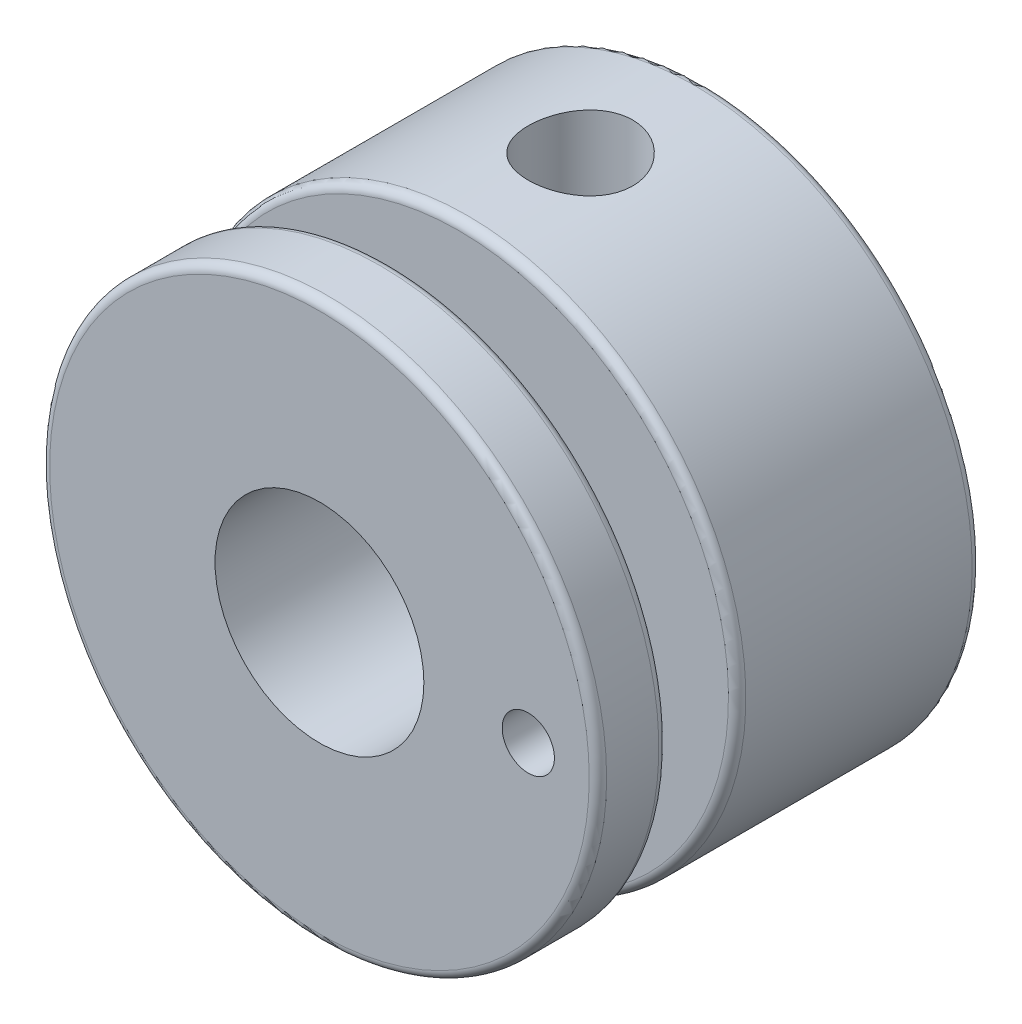
ISO-10303-21;
HEADER;
FILE_DESCRIPTION(('STEP AP214'),'2;1');
FILE_NAME('part.step','',(''),(''),'','','');
FILE_SCHEMA(('AUTOMOTIVE_DESIGN { 1 0 10303 214 1 1 1 1 }'));
ENDSEC;
DATA;
#1=APPLICATION_CONTEXT('core data for automotive mechanical design processes');
#2=APPLICATION_PROTOCOL_DEFINITION('international standard','automotive_design',2000,#1);
#3=PRODUCT_CONTEXT('',#1,'mechanical');
#4=PRODUCT('Part','Part','',(#3));
#5=PRODUCT_RELATED_PRODUCT_CATEGORY('part','',(#4));
#6=PRODUCT_DEFINITION_FORMATION('','',#4);
#7=PRODUCT_DEFINITION_CONTEXT('part definition',#1,'design');
#8=PRODUCT_DEFINITION('design','',#6,#7);
#9=PRODUCT_DEFINITION_SHAPE('','',#8);
#10=(LENGTH_UNIT() NAMED_UNIT(*) SI_UNIT(.MILLI.,.METRE.));
#11=(NAMED_UNIT(*) PLANE_ANGLE_UNIT() SI_UNIT($,.RADIAN.));
#12=(NAMED_UNIT(*) SI_UNIT($,.STERADIAN.) SOLID_ANGLE_UNIT());
#13=UNCERTAINTY_MEASURE_WITH_UNIT(LENGTH_MEASURE(1.E-05),#10,'distance_accuracy_value','');
#14=(GEOMETRIC_REPRESENTATION_CONTEXT(3) GLOBAL_UNCERTAINTY_ASSIGNED_CONTEXT((#13)) GLOBAL_UNIT_ASSIGNED_CONTEXT((#10,
#11,#12)) REPRESENTATION_CONTEXT('',''));
#15=CARTESIAN_POINT('',(0.,0.,0.));
#16=DIRECTION('',(0.,0.,1.));
#17=DIRECTION('',(1.,0.,0.));
#18=AXIS2_PLACEMENT_3D('',#15,#16,#17);
#19=CARTESIAN_POINT('',(0.,8.001,3.5));
#20=DIRECTION('',(0.,-1.,0.));
#21=DIRECTION('',(0.,0.,-1.));
#22=AXIS2_PLACEMENT_3D('',#19,#20,#21);
#23=CYLINDRICAL_SURFACE('',#22,1.5);
#24=CARTESIAN_POINT('',(0.,8.,2.));
#25=CARTESIAN_POINT('',(0.0834717464654708,7.99999848833852,2.00000318958828));
#26=CARTESIAN_POINT('',(0.166984992730098,7.99868009921714,2.00699107661938));
#27=CARTESIAN_POINT('',(0.331658129841797,7.9935478589052,2.03473999511835));
#28=CARTESIAN_POINT('',(0.412815974152225,7.98973190166897,2.05551265063973));
#29=CARTESIAN_POINT('',(0.570372961851801,7.98003138765458,2.11017270125934));
#30=CARTESIAN_POINT('',(0.646776330685343,7.97414869946483,2.14404825245254));
#31=CARTESIAN_POINT('',(0.792807973094006,7.96095710599783,2.22391887692282));
#32=CARTESIAN_POINT('',(0.862436794477323,7.9536483161829,2.26991296914482));
#33=CARTESIAN_POINT('',(0.993783715930503,7.93831336430504,2.37329976800367));
#34=CARTESIAN_POINT('',(1.05540895503183,7.93028034856351,2.43080944467014));
#35=CARTESIAN_POINT('',(1.16819606135369,7.9144531845865,2.55534330908756));
#36=CARTESIAN_POINT('',(1.21935717689241,7.90665905354527,2.62236817976929));
#37=CARTESIAN_POINT('',(1.31014998665793,7.89212551245005,2.76468608836397));
#38=CARTESIAN_POINT('',(1.34968721969605,7.88539493886182,2.84004037031724));
#39=CARTESIAN_POINT('',(1.41550524332283,7.87384713211987,2.99646891517679));
#40=CARTESIAN_POINT('',(1.44178717713098,7.86902973396962,3.07754268411122));
#41=CARTESIAN_POINT('',(1.480050535035,7.8619226957455,3.24211523091441));
#42=CARTESIAN_POINT('',(1.49219390192039,7.85960445366405,3.32557509720346));
#43=CARTESIAN_POINT('',(1.50233808095346,7.85767197152761,3.49337738480825));
#44=CARTESIAN_POINT('',(1.50034016135374,7.8580574889876,3.5777197263023));
#45=CARTESIAN_POINT('',(1.48238979602362,7.86146292701753,3.74371952526605));
#46=CARTESIAN_POINT('',(1.46662149996045,7.86444808147334,3.82539771430015));
#47=CARTESIAN_POINT('',(1.42186799396207,7.87266183284666,3.98492841978261));
#48=CARTESIAN_POINT('',(1.39288222239499,7.87789052509516,4.0627807735093));
#49=CARTESIAN_POINT('',(1.322336471793,7.89003855292589,4.21298867900026));
#50=CARTESIAN_POINT('',(1.28070213532456,7.89696783823366,4.28530847058081));
#51=CARTESIAN_POINT('',(1.18609368930416,7.91172971602918,4.42200472854023));
#52=CARTESIAN_POINT('',(1.13311842889266,7.91956240015522,4.4863803877148));
#53=CARTESIAN_POINT('',(1.01633905685298,7.93540001272164,4.60642495567246));
#54=CARTESIAN_POINT('',(0.952377436860682,7.94340571024031,4.66194065245174));
#55=CARTESIAN_POINT('',(0.815968037098826,7.95857386108318,4.7614772406754));
#56=CARTESIAN_POINT('',(0.743520172255769,7.96573630595245,4.80549801687042));
#57=CARTESIAN_POINT('',(0.592034988874668,7.97842539677509,4.88081775387002));
#58=CARTESIAN_POINT('',(0.512989564446494,7.98394999136289,4.9121007791179));
#59=CARTESIAN_POINT('',(0.350639115398697,7.99272505402719,4.96090209309216));
#60=CARTESIAN_POINT('',(0.267334544277787,7.99597576367994,4.97842184404536));
#61=CARTESIAN_POINT('',(0.100148652903385,7.99980360641981,4.99898603101827));
#62=CARTESIAN_POINT('',(0.0162940126341353,8.00041950912279,5.00224039152973));
#63=CARTESIAN_POINT('',(-0.150761248092184,7.99901543598228,4.99474452045235));
#64=CARTESIAN_POINT('',(-0.233961900480385,7.99699558964431,4.98399497693474));
#65=CARTESIAN_POINT('',(-0.396681573218217,7.99057111500406,4.94897096481663));
#66=CARTESIAN_POINT('',(-0.476224261046063,7.98618522374031,4.92480271746219));
#67=CARTESIAN_POINT('',(-0.630128631824633,7.97551842212498,4.86374229322121));
#68=CARTESIAN_POINT('',(-0.704489962595103,7.96923738311334,4.82684925243421));
#69=CARTESIAN_POINT('',(-0.846816671513213,7.95538030357666,4.74092187184049));
#70=CARTESIAN_POINT('',(-0.91470327701512,7.94779086174563,4.69175926146316));
#71=CARTESIAN_POINT('',(-1.04133832326454,7.93219343489712,4.58286186263764));
#72=CARTESIAN_POINT('',(-1.10008590976087,7.92418541084687,4.52312608699867));
#73=CARTESIAN_POINT('',(-1.20757295872048,7.9085247569745,4.39382768108857));
#74=CARTESIAN_POINT('',(-1.25616916218577,7.90087825860257,4.32414509187461));
#75=CARTESIAN_POINT('',(-1.34096675057787,7.88692985578532,4.17748237547625));
#76=CARTESIAN_POINT('',(-1.37716859613924,7.8806279013735,4.10050251962953));
#77=CARTESIAN_POINT('',(-1.43594673512823,7.87013024209574,3.94179413275746));
#78=CARTESIAN_POINT('',(-1.45858868794786,7.86592440436878,3.86009062044067));
#79=CARTESIAN_POINT('',(-1.48980679326235,7.86007203802415,3.6939527774786));
#80=CARTESIAN_POINT('',(-1.49838453270708,7.8584252206579,3.6095187560296));
#81=CARTESIAN_POINT('',(-1.50117762148355,7.85789199803857,3.44175166855849));
#82=CARTESIAN_POINT('',(-1.49561895003499,7.85896215974293,3.358422419043));
#83=CARTESIAN_POINT('',(-1.47079175378803,7.86364600659998,3.19390857795471));
#84=CARTESIAN_POINT('',(-1.45152331089332,7.86725967655747,3.11272397357256));
#85=CARTESIAN_POINT('',(-1.39991887583263,7.8766050802318,2.95492551520452));
#86=CARTESIAN_POINT('',(-1.36760735397252,7.88233284594965,2.87830340865423));
#87=CARTESIAN_POINT('',(-1.29085868912204,7.8952638755184,2.73153174575916));
#88=CARTESIAN_POINT('',(-1.24642068948186,7.90246724360119,2.66138264715522));
#89=CARTESIAN_POINT('',(-1.14589487339535,7.91767266107745,2.52841631995771));
#90=CARTESIAN_POINT('',(-1.08964259864303,7.92568505353043,2.4657245874329));
#91=CARTESIAN_POINT('',(-0.967427926742291,7.94152833918735,2.35059483753548));
#92=CARTESIAN_POINT('',(-0.901463301891615,7.94935919027328,2.29815917901986));
#93=CARTESIAN_POINT('',(-0.760984945071872,7.96403975968049,2.20458904737294));
#94=CARTESIAN_POINT('',(-0.686399590640516,7.97088000990561,2.16356057150936));
#95=CARTESIAN_POINT('',(-0.531290113653834,7.98271619380687,2.09468236339486));
#96=CARTESIAN_POINT('',(-0.450771651705248,7.98771385879037,2.06682025295309));
#97=CARTESIAN_POINT('',(-0.308347202825154,7.99428290707632,2.03072268558133));
#98=CARTESIAN_POINT('',(-0.24727381025187,7.99641470878206,2.0192213696872));
#99=CARTESIAN_POINT('',(-0.124141247115158,7.9992737995401,2.00385893788355));
#100=CARTESIAN_POINT('',(-0.0620821016527093,8.00000112429805,1.99999762774409));
#101=CARTESIAN_POINT('',(0.,8.,2.));
#102=B_SPLINE_CURVE_WITH_KNOTS('',3,(#24,#25,#26,#27,#28,#29,#30,#31,#32,#33,#34,#35,#36,#37,
#38,#39,#40,#41,#42,#43,#44,#45,#46,#47,#48,#49,#50,#51,#52,#53,#54,#55,#56,#57,#58,#59,#60,#61,
#62,#63,#64,#65,#66,#67,#68,#69,#70,#71,#72,#73,#74,#75,#76,#77,#78,#79,#80,#81,#82,#83,#84,#85,
#86,#87,#88,#89,#90,#91,#92,#93,#94,#95,#96,#97,#98,#99,#100,#101),.UNSPECIFIED.,.T.,.F.,(4,2,2,
2,2,2,2,2,2,2,2,2,2,2,2,2,2,2,2,2,2,2,2,2,2,2,2,2,2,2,2,2,2,2,2,2,2,2,4),(0.,0.250188200964924,
0.500587642535452,0.750761271230907,1.00091465336891,1.2537511801363,1.50660586283617,
1.76146190504357,2.01629596311948,2.26818151445336,2.52004447587256,2.76859000612765,
3.01714609846786,3.2671926262953,3.51726454049859,3.77127768464077,4.02529337544948,
4.27962588321699,4.53393136673745,4.78448174076097,5.03501980464583,5.28360233907828,
5.53220175338032,5.78351778017708,6.03485728413098,6.28953436987299,6.54420198954945,
6.79762627818559,7.05102196946513,7.30039252231748,7.54976158541507,7.79866496207692,
8.04758592655423,8.3002336996638,8.55293951262255,8.80792048916314,9.06266126931173,
9.24874344524409,9.43482089039541),.UNSPECIFIED.);
#103=CARTESIAN_POINT('',(0.,8.,2.));
#104=VERTEX_POINT('',#103);
#105=EDGE_CURVE('E91',#104,#104,#102,.T.);
#106=ORIENTED_EDGE('',*,*,#105,.F.);
#107=EDGE_LOOP('',(#106));
#108=FACE_BOUND('',#107,.T.);
#109=CARTESIAN_POINT('',(0.,3.,2.));
#110=CARTESIAN_POINT('',(-0.0788579444268501,2.99999570107562,2.00000495347579));
#111=CARTESIAN_POINT('',(-0.157809899546344,2.99685736529635,2.00625510968158));
#112=CARTESIAN_POINT('',(-0.313380352903344,2.98461234055735,2.03097932051231));
#113=CARTESIAN_POINT('',(-0.389994130070444,2.97549431743379,2.04947658949672));
#114=CARTESIAN_POINT('',(-0.538400317320673,2.95224419105063,2.09779071292494));
#115=CARTESIAN_POINT('',(-0.610210204408719,2.93813158766306,2.12756357637195));
#116=CARTESIAN_POINT('',(-0.747708925209898,2.90618664773642,2.19735593204748));
#117=CARTESIAN_POINT('',(-0.813398240985088,2.88835460450288,2.2373746163733));
#118=CARTESIAN_POINT('',(-0.941261726642864,2.84934387387093,2.32927587422793));
#119=CARTESIAN_POINT('',(-1.00298281668316,2.82802798691306,2.38172971885946));
#120=CARTESIAN_POINT('',(-1.11716916730047,2.78489955370115,2.49578221887055));
#121=CARTESIAN_POINT('',(-1.16962737466015,2.76308664313552,2.55738777765866));
#122=CARTESIAN_POINT('',(-1.26787800067542,2.71948426796021,2.69372502428507));
#123=CARTESIAN_POINT('',(-1.31283800332745,2.69782780455198,2.76910414751887));
#124=CARTESIAN_POINT('',(-1.38925234033604,2.65928968158481,2.92755100397932));
#125=CARTESIAN_POINT('',(-1.4207163224495,2.64240461410484,3.01061319308412));
#126=CARTESIAN_POINT('',(-1.46719866328288,2.61686800556713,3.17699765813288));
#127=CARTESIAN_POINT('',(-1.48308878562066,2.6077840737557,3.26000667810109));
#128=CARTESIAN_POINT('',(-1.50064048996327,2.59772834922792,3.42796825666921));
#129=CARTESIAN_POINT('',(-1.50231613255961,2.59674854014932,3.51291881130673));
#130=CARTESIAN_POINT('',(-1.49203093075844,2.60266395385873,3.67142903647305));
#131=CARTESIAN_POINT('',(-1.48167683930523,2.6086314549302,3.74513604683458));
#132=CARTESIAN_POINT('',(-1.4504097735854,2.62614343100775,3.88958286405956));
#133=CARTESIAN_POINT('',(-1.42949343584648,2.63768968247664,3.96032171795797));
#134=CARTESIAN_POINT('',(-1.37731467057901,2.66531214619112,4.09884369884849));
#135=CARTESIAN_POINT('',(-1.34582260067399,2.68148760995998,4.16651959817868));
#136=CARTESIAN_POINT('',(-1.273562531502,2.71655106422106,4.29595143888501));
#137=CARTESIAN_POINT('',(-1.2327903657187,2.73544027170286,4.35770470340013));
#138=CARTESIAN_POINT('',(-1.13709908236918,2.77669736854929,4.48178187911484));
#139=CARTESIAN_POINT('',(-1.08104168755392,2.79920265355119,4.54318531036424));
#140=CARTESIAN_POINT('',(-0.95933336811206,2.84321434950611,4.65610312788635));
#141=CARTESIAN_POINT('',(-0.893677884861428,2.86472027938201,4.70761278805082));
#142=CARTESIAN_POINT('',(-0.750774758747772,2.90552980924446,4.80152849154459));
#143=CARTESIAN_POINT('',(-0.673130387399113,2.92468476243011,4.84340070866861));
#144=CARTESIAN_POINT('',(-0.510699323233194,2.95736821681863,4.91314554356451));
#145=CARTESIAN_POINT('',(-0.425918364397913,2.9709011841533,4.94102927752275));
#146=CARTESIAN_POINT('',(-0.259149737491053,2.98986500612153,4.97971310557501));
#147=CARTESIAN_POINT('',(-0.177512295822489,2.99587407451965,4.99173685362017));
#148=CARTESIAN_POINT('',(-0.013169399924027,3.00109520188655,5.00219709670173));
#149=CARTESIAN_POINT('',(0.0695355298048635,3.00031048081978,5.0006400284592));
#150=CARTESIAN_POINT('',(0.226849457978981,2.99236788380152,4.98468996737188));
#151=CARTESIAN_POINT('',(0.301589112074895,2.98570868532252,4.97130120090501));
#152=CARTESIAN_POINT('',(0.447610338452912,2.9673325697226,4.93364289215732));
#153=CARTESIAN_POINT('',(0.518891528536631,2.95561509501618,4.90937215031976));
#154=CARTESIAN_POINT('',(0.658332912674359,2.92776377120382,4.85000230035045));
#155=CARTESIAN_POINT('',(0.726345595508705,2.91151322654446,4.81461342482557));
#156=CARTESIAN_POINT('',(0.855692042548907,2.87615961476126,4.73433869653015));
#157=CARTESIAN_POINT('',(0.917022944664887,2.85705533350407,4.68944879810691));
#158=CARTESIAN_POINT('',(1.03765153393382,2.81562332004297,4.58635936200393));
#159=CARTESIAN_POINT('',(1.09615811672854,2.79316327265249,4.52728569733228));
#160=CARTESIAN_POINT('',(1.20278448167828,2.7489358741323,4.40011227308341));
#161=CARTESIAN_POINT('',(1.25089707856781,2.72716901100071,4.33200632172812));
#162=CARTESIAN_POINT('',(1.33756187171853,2.68576788309734,4.18453451874054));
#163=CARTESIAN_POINT('',(1.37553824370037,2.66628794383591,4.10478310085828));
#164=CARTESIAN_POINT('',(1.43712423890206,2.63361108441202,3.93873489863755));
#165=CARTESIAN_POINT('',(1.46075237380052,2.62040607332625,3.85244671029966));
#166=CARTESIAN_POINT('',(1.49079253120031,2.60342251538703,3.68463466567294));
#167=CARTESIAN_POINT('',(1.49863949460818,2.59886075197597,3.60344861984714));
#168=CARTESIAN_POINT('',(1.5010337315643,2.59748031962405,3.44082939925321));
#169=CARTESIAN_POINT('',(1.49558676993486,2.60065829439585,3.35939634689321));
#170=CARTESIAN_POINT('',(1.47288918838996,2.61356793076615,3.20677474769984));
#171=CARTESIAN_POINT('',(1.45681247151455,2.62264641723988,3.13534929478289));
#172=CARTESIAN_POINT('',(1.41476303733662,2.64556524281479,2.99628782086345));
#173=CARTESIAN_POINT('',(1.38878713673988,2.65940711354503,2.92865302686195));
#174=CARTESIAN_POINT('',(1.32572361795085,2.69142795546804,2.79406272352019));
#175=CARTESIAN_POINT('',(1.28800670672355,2.70983583593881,2.72745814725646));
#176=CARTESIAN_POINT('',(1.20322645745609,2.74852997452291,2.60108819572811));
#177=CARTESIAN_POINT('',(1.15615825686234,2.76881720693416,2.54132640421833));
#178=CARTESIAN_POINT('',(1.04730498999206,2.81193484737138,2.42278702646799));
#179=CARTESIAN_POINT('',(0.984426634495891,2.83477474959942,2.36501134647456));
#180=CARTESIAN_POINT('',(0.849232209349795,2.87816628389896,2.2606055248471));
#181=CARTESIAN_POINT('',(0.776911084957795,2.89871667939293,2.21398139079514));
#182=CARTESIAN_POINT('',(0.623897395174418,2.93547014349806,2.13314545593189));
#183=CARTESIAN_POINT('',(0.543149255665095,2.95164144740899,2.0990237461453));
#184=CARTESIAN_POINT('',(0.376113151707129,2.9775201194848,2.04528774836389));
#185=CARTESIAN_POINT('',(0.289841699383649,2.98724585044602,2.02563222979143));
#186=CARTESIAN_POINT('',(0.168902919736342,2.99543192870217,2.00915388337139));
#187=CARTESIAN_POINT('',(0.135242819162346,2.99714048010376,2.00572603870049));
#188=CARTESIAN_POINT('',(0.0677275977076369,2.99942545465223,2.00114800172887));
#189=CARTESIAN_POINT('',(0.0338724714699424,3.00000184655072,1.99999787229469));
#190=CARTESIAN_POINT('',(0.,3.,2.));
#191=B_SPLINE_CURVE_WITH_KNOTS('',3,(#109,#110,#111,#112,#113,#114,#115,#116,#117,#118,#119,
#120,#121,#122,#123,#124,#125,#126,#127,#128,#129,#130,#131,#132,#133,#134,#135,#136,#137,#138,
#139,#140,#141,#142,#143,#144,#145,#146,#147,#148,#149,#150,#151,#152,#153,#154,#155,#156,#157,
#158,#159,#160,#161,#162,#163,#164,#165,#166,#167,#168,#169,#170,#171,#172,#173,#174,#175,#176,
#177,#178,#179,#180,#181,#182,#183,#184,#185,#186,#187,#188,#189,#190),.UNSPECIFIED.,.T.,.F.,(4,
2,2,2,2,2,2,2,2,2,2,2,2,2,2,2,2,2,2,2,2,2,2,2,2,2,2,2,2,2,2,2,2,2,2,2,2,2,2,2,4),(0.,
0.236436386130439,0.473322224563796,0.709293233238447,0.945245640872351,1.19547263807713,
1.44588935648105,1.71572589646129,1.98536921847421,2.23887018210344,2.49212035993531,
2.71508568613981,2.93812205888518,3.16635360252731,3.39468781890333,3.65197412000818,
3.9093830189803,4.17874533321661,4.44789325368419,4.69474935707018,4.94148846767214,
5.16910359759183,5.39674382446397,5.63089284041848,5.86514176122509,6.12239415966628,
6.37982382923148,6.64972023242589,6.91926767918176,7.1629396125457,7.40650589797018,
7.62686895373284,7.84730293182527,8.08254685170431,8.31791341715446,8.58187864135757,
8.84598575071869,9.1119602049529,9.37717362931724,9.47872920200875,9.58028757766599),.UNSPECIFIED.);
#192=CARTESIAN_POINT('',(0.,3.,2.));
#193=VERTEX_POINT('',#192);
#194=EDGE_CURVE('E115',#193,#193,#191,.T.);
#195=ORIENTED_EDGE('',*,*,#194,.F.);
#196=EDGE_LOOP('',(#195));
#197=FACE_BOUND('',#196,.T.);
#198=ADVANCED_FACE('F43',(#108,#197),#23,.F.);
#199=CARTESIAN_POINT('',(0.,0.,11.));
#200=DIRECTION('',(0.,0.,-1.));
#201=DIRECTION('',(-1.,0.,0.));
#202=AXIS2_PLACEMENT_3D('',#199,#200,#201);
#203=CYLINDRICAL_SURFACE('',#202,8.);
#204=CARTESIAN_POINT('',(0.,0.,0.25));
#205=DIRECTION('',(0.,0.,1.));
#206=DIRECTION('',(1.,0.,0.));
#207=AXIS2_PLACEMENT_3D('',#204,#205,#206);
#208=CIRCLE('',#207,8.);
#209=CARTESIAN_POINT('',(8.,0.,0.25));
#210=VERTEX_POINT('',#209);
#211=EDGE_CURVE('E61',#210,#210,#208,.T.);
#212=ORIENTED_EDGE('',*,*,#211,.T.);
#213=EDGE_LOOP('',(#212));
#214=FACE_BOUND('',#213,.T.);
#215=CARTESIAN_POINT('',(0.,0.,6.75));
#216=DIRECTION('',(0.,0.,-1.));
#217=DIRECTION('',(0.,1.,0.));
#218=AXIS2_PLACEMENT_3D('',#215,#216,#217);
#219=CIRCLE('',#218,8.);
#220=CARTESIAN_POINT('',(0.,8.,6.75));
#221=VERTEX_POINT('',#220);
#222=EDGE_CURVE('E71',#221,#221,#219,.T.);
#223=ORIENTED_EDGE('',*,*,#222,.T.);
#224=EDGE_LOOP('',(#223));
#225=FACE_BOUND('',#224,.T.);
#226=ORIENTED_EDGE('',*,*,#105,.T.);
#227=EDGE_LOOP('',(#226));
#228=FACE_BOUND('',#227,.T.);
#229=ADVANCED_FACE('F157',(#214,#225,#228),#203,.T.);
#230=CARTESIAN_POINT('',(0.,0.,10.75));
#231=DIRECTION('',(0.,0.,1.));
#232=DIRECTION('',(1.,0.,0.));
#233=AXIS2_PLACEMENT_3D('',#230,#231,#232);
#234=CIRCLE('',#233,8.);
#235=CARTESIAN_POINT('',(8.,0.,10.75));
#236=VERTEX_POINT('',#235);
#237=EDGE_CURVE('E10',#236,#236,#234,.F.);
#238=ORIENTED_EDGE('',*,*,#237,.T.);
#239=EDGE_LOOP('',(#238));
#240=FACE_BOUND('',#239,.T.);
#241=CARTESIAN_POINT('',(0.,0.,9.25));
#242=DIRECTION('',(0.,0.,1.));
#243=DIRECTION('',(0.,-1.,0.));
#244=AXIS2_PLACEMENT_3D('',#241,#242,#243);
#245=CIRCLE('',#244,8.);
#246=CARTESIAN_POINT('',(0.,-8.,9.25));
#247=VERTEX_POINT('',#246);
#248=EDGE_CURVE('E75',#247,#247,#245,.T.);
#249=ORIENTED_EDGE('',*,*,#248,.T.);
#250=EDGE_LOOP('',(#249));
#251=FACE_BOUND('',#250,.T.);
#252=ADVANCED_FACE('F162',(#240,#251),#203,.T.);
#253=CARTESIAN_POINT('',(0.,0.,11.));
#254=DIRECTION('',(0.,0.,1.));
#255=DIRECTION('',(1.,0.,0.));
#256=AXIS2_PLACEMENT_3D('',#253,#254,#255);
#257=PLANE('',#256);
#258=CARTESIAN_POINT('',(6.,0.,11.));
#259=DIRECTION('',(0.,0.,1.));
#260=DIRECTION('',(1.,0.,0.));
#261=AXIS2_PLACEMENT_3D('',#258,#259,#260);
#262=CIRCLE('',#261,0.75);
#263=CARTESIAN_POINT('',(6.75,0.,11.));
#264=VERTEX_POINT('',#263);
#265=EDGE_CURVE('E127',#264,#264,#262,.T.);
#266=ORIENTED_EDGE('',*,*,#265,.F.);
#267=EDGE_LOOP('',(#266));
#268=FACE_BOUND('',#267,.T.);
#269=CARTESIAN_POINT('',(0.,0.,11.));
#270=DIRECTION('',(0.,0.,1.));
#271=DIRECTION('',(1.,0.,0.));
#272=AXIS2_PLACEMENT_3D('',#269,#270,#271);
#273=CIRCLE('',#272,7.75);
#274=CARTESIAN_POINT('',(7.75,0.,11.));
#275=VERTEX_POINT('',#274);
#276=EDGE_CURVE('E51',#275,#275,#273,.T.);
#277=ORIENTED_EDGE('',*,*,#276,.T.);
#278=EDGE_LOOP('',(#277));
#279=FACE_BOUND('',#278,.T.);
#280=CARTESIAN_POINT('',(0.,0.,11.));
#281=DIRECTION('',(0.,0.,1.));
#282=DIRECTION('',(1.,0.,0.));
#283=AXIS2_PLACEMENT_3D('',#280,#281,#282);
#284=CIRCLE('',#283,3.);
#285=CARTESIAN_POINT('',(3.,0.,11.));
#286=VERTEX_POINT('',#285);
#287=EDGE_CURVE('E100',#286,#286,#284,.T.);
#288=ORIENTED_EDGE('',*,*,#287,.F.);
#289=EDGE_LOOP('',(#288));
#290=FACE_BOUND('',#289,.T.);
#291=ADVANCED_FACE('F141',(#268,#279,#290),#257,.T.);
#292=CARTESIAN_POINT('',(0.,8.,9.));
#293=DIRECTION('',(0.,0.,1.));
#294=DIRECTION('',(0.,-1.,0.));
#295=AXIS2_PLACEMENT_3D('',#292,#293,#294);
#296=PLANE('',#295);
#297=CARTESIAN_POINT('',(6.,0.,9.));
#298=DIRECTION('',(0.,0.,1.));
#299=DIRECTION('',(0.,-1.,0.));
#300=AXIS2_PLACEMENT_3D('',#297,#298,#299);
#301=CIRCLE('',#300,0.75);
#302=CARTESIAN_POINT('',(6.,-0.75,9.));
#303=VERTEX_POINT('',#302);
#304=EDGE_CURVE('E126',#303,#303,#301,.F.);
#305=ORIENTED_EDGE('',*,*,#304,.F.);
#306=EDGE_LOOP('',(#305));
#307=FACE_BOUND('',#306,.T.);
#308=CARTESIAN_POINT('',(0.,0.,9.));
#309=DIRECTION('',(0.,0.,1.));
#310=DIRECTION('',(0.,-1.,0.));
#311=AXIS2_PLACEMENT_3D('',#308,#309,#310);
#312=CIRCLE('',#311,7.75);
#313=CARTESIAN_POINT('',(0.,-7.75,9.));
#314=VERTEX_POINT('',#313);
#315=EDGE_CURVE('E79',#314,#314,#312,.F.);
#316=ORIENTED_EDGE('',*,*,#315,.T.);
#317=EDGE_LOOP('',(#316));
#318=FACE_BOUND('',#317,.T.);
#319=CARTESIAN_POINT('',(0.,0.,9.));
#320=DIRECTION('',(0.,0.,-1.));
#321=DIRECTION('',(0.,1.,0.));
#322=AXIS2_PLACEMENT_3D('',#319,#320,#321);
#323=CIRCLE('',#322,5.);
#324=CARTESIAN_POINT('',(0.,5.,9.));
#325=VERTEX_POINT('',#324);
#326=EDGE_CURVE('E83',#325,#325,#323,.T.);
#327=ORIENTED_EDGE('',*,*,#326,.F.);
#328=EDGE_LOOP('',(#327));
#329=FACE_BOUND('',#328,.T.);
#330=ADVANCED_FACE('F137',(#307,#318,#329),#296,.F.);
#331=CARTESIAN_POINT('',(0.,0.,-5.24948517485831));
#332=DIRECTION('',(0.,0.,-1.));
#333=DIRECTION('',(0.,1.,0.));
#334=AXIS2_PLACEMENT_3D('',#331,#332,#333);
#335=CYLINDRICAL_SURFACE('',#334,5.);
#336=CARTESIAN_POINT('',(0.,0.,7.));
#337=DIRECTION('',(0.,0.,-1.));
#338=DIRECTION('',(0.,1.,0.));
#339=AXIS2_PLACEMENT_3D('',#336,#337,#338);
#340=CIRCLE('',#339,5.);
#341=CARTESIAN_POINT('',(0.,5.,7.));
#342=VERTEX_POINT('',#341);
#343=EDGE_CURVE('E87',#342,#342,#340,.T.);
#344=ORIENTED_EDGE('',*,*,#343,.F.);
#345=EDGE_LOOP('',(#344));
#346=FACE_BOUND('',#345,.T.);
#347=ORIENTED_EDGE('',*,*,#326,.T.);
#348=EDGE_LOOP('',(#347));
#349=FACE_BOUND('',#348,.T.);
#350=ADVANCED_FACE('F140',(#346,#349),#335,.T.);
#351=CARTESIAN_POINT('',(0.,8.,7.));
#352=DIRECTION('',(0.,0.,-1.));
#353=DIRECTION('',(0.,1.,0.));
#354=AXIS2_PLACEMENT_3D('',#351,#352,#353);
#355=PLANE('',#354);
#356=CARTESIAN_POINT('',(0.,0.,7.));
#357=DIRECTION('',(0.,0.,-1.));
#358=DIRECTION('',(0.,1.,0.));
#359=AXIS2_PLACEMENT_3D('',#356,#357,#358);
#360=CIRCLE('',#359,7.75);
#361=CARTESIAN_POINT('',(0.,7.75,7.));
#362=VERTEX_POINT('',#361);
#363=EDGE_CURVE('E67',#362,#362,#360,.F.);
#364=ORIENTED_EDGE('',*,*,#363,.T.);
#365=EDGE_LOOP('',(#364));
#366=FACE_BOUND('',#365,.T.);
#367=ORIENTED_EDGE('',*,*,#343,.T.);
#368=EDGE_LOOP('',(#367));
#369=FACE_BOUND('',#368,.T.);
#370=ADVANCED_FACE('F148',(#366,#369),#355,.F.);
#371=CARTESIAN_POINT('',(0.,0.,0.));
#372=DIRECTION('',(0.,0.,1.));
#373=DIRECTION('',(1.,0.,0.));
#374=AXIS2_PLACEMENT_3D('',#371,#372,#373);
#375=PLANE('',#374);
#376=CARTESIAN_POINT('',(0.,0.,0.));
#377=DIRECTION('',(0.,0.,1.));
#378=DIRECTION('',(1.,0.,0.));
#379=AXIS2_PLACEMENT_3D('',#376,#377,#378);
#380=CIRCLE('',#379,7.75);
#381=CARTESIAN_POINT('',(7.75,0.,0.));
#382=VERTEX_POINT('',#381);
#383=EDGE_CURVE('E56',#382,#382,#380,.F.);
#384=ORIENTED_EDGE('',*,*,#383,.T.);
#385=EDGE_LOOP('',(#384));
#386=FACE_BOUND('',#385,.T.);
#387=CARTESIAN_POINT('',(0.,0.,0.));
#388=DIRECTION('',(0.,0.,1.));
#389=DIRECTION('',(1.,0.,0.));
#390=AXIS2_PLACEMENT_3D('',#387,#388,#389);
#391=CIRCLE('',#390,3.);
#392=CARTESIAN_POINT('',(3.,0.,0.));
#393=VERTEX_POINT('',#392);
#394=EDGE_CURVE('E122',#393,#393,#391,.T.);
#395=ORIENTED_EDGE('',*,*,#394,.T.);
#396=EDGE_LOOP('',(#395));
#397=FACE_BOUND('',#396,.T.);
#398=ADVANCED_FACE('F111',(#386,#397),#375,.F.);
#399=CARTESIAN_POINT('',(0.,0.,11.001));
#400=DIRECTION('',(0.,0.,-1.));
#401=DIRECTION('',(-1.,0.,0.));
#402=AXIS2_PLACEMENT_3D('',#399,#400,#401);
#403=CYLINDRICAL_SURFACE('',#402,3.);
#404=ORIENTED_EDGE('',*,*,#287,.T.);
#405=EDGE_LOOP('',(#404));
#406=FACE_BOUND('',#405,.T.);
#407=ORIENTED_EDGE('',*,*,#194,.T.);
#408=EDGE_LOOP('',(#407));
#409=FACE_BOUND('',#408,.T.);
#410=ORIENTED_EDGE('',*,*,#394,.F.);
#411=EDGE_LOOP('',(#410));
#412=FACE_BOUND('',#411,.T.);
#413=ADVANCED_FACE('F106',(#406,#409,#412),#403,.F.);
#414=CARTESIAN_POINT('',(0.,0.,9.25));
#415=DIRECTION('',(0.,0.,1.));
#416=DIRECTION('',(0.,-1.,0.));
#417=AXIS2_PLACEMENT_3D('',#414,#415,#416);
#418=TOROIDAL_SURFACE('',#417,7.75,0.25);
#419=ORIENTED_EDGE('',*,*,#248,.F.);
#420=EDGE_LOOP('',(#419));
#421=FACE_BOUND('',#420,.T.);
#422=ORIENTED_EDGE('',*,*,#315,.F.);
#423=EDGE_LOOP('',(#422));
#424=FACE_BOUND('',#423,.T.);
#425=ADVANCED_FACE('F110',(#421,#424),#418,.T.);
#426=CARTESIAN_POINT('',(0.,0.,6.75));
#427=DIRECTION('',(0.,0.,-1.));
#428=DIRECTION('',(0.,1.,0.));
#429=AXIS2_PLACEMENT_3D('',#426,#427,#428);
#430=TOROIDAL_SURFACE('',#429,7.75,0.25);
#431=ORIENTED_EDGE('',*,*,#363,.F.);
#432=EDGE_LOOP('',(#431));
#433=FACE_BOUND('',#432,.T.);
#434=ORIENTED_EDGE('',*,*,#222,.F.);
#435=EDGE_LOOP('',(#434));
#436=FACE_BOUND('',#435,.T.);
#437=ADVANCED_FACE('F183',(#433,#436),#430,.T.);
#438=CARTESIAN_POINT('',(0.,0.,0.25));
#439=DIRECTION('',(0.,0.,1.));
#440=DIRECTION('',(1.,0.,0.));
#441=AXIS2_PLACEMENT_3D('',#438,#439,#440);
#442=TOROIDAL_SURFACE('',#441,7.75,0.25);
#443=ORIENTED_EDGE('',*,*,#383,.F.);
#444=EDGE_LOOP('',(#443));
#445=FACE_BOUND('',#444,.T.);
#446=ORIENTED_EDGE('',*,*,#211,.F.);
#447=EDGE_LOOP('',(#446));
#448=FACE_BOUND('',#447,.T.);
#449=ADVANCED_FACE('F186',(#445,#448),#442,.T.);
#450=CARTESIAN_POINT('',(0.,0.,10.75));
#451=DIRECTION('',(0.,0.,1.));
#452=DIRECTION('',(1.,0.,0.));
#453=AXIS2_PLACEMENT_3D('',#450,#451,#452);
#454=TOROIDAL_SURFACE('',#453,7.75,0.25);
#455=ORIENTED_EDGE('',*,*,#237,.F.);
#456=EDGE_LOOP('',(#455));
#457=FACE_BOUND('',#456,.T.);
#458=ORIENTED_EDGE('',*,*,#276,.F.);
#459=EDGE_LOOP('',(#458));
#460=FACE_BOUND('',#459,.T.);
#461=ADVANCED_FACE('F45',(#457,#460),#454,.T.);
#462=CARTESIAN_POINT('',(6.,0.,-0.000999999999999265));
#463=DIRECTION('',(0.,0.,1.));
#464=DIRECTION('',(1.,0.,0.));
#465=AXIS2_PLACEMENT_3D('',#462,#463,#464);
#466=CYLINDRICAL_SURFACE('',#465,0.75);
#467=ORIENTED_EDGE('',*,*,#265,.T.);
#468=EDGE_LOOP('',(#467));
#469=FACE_BOUND('',#468,.T.);
#470=ORIENTED_EDGE('',*,*,#304,.T.);
#471=EDGE_LOOP('',(#470));
#472=FACE_BOUND('',#471,.T.);
#473=ADVANCED_FACE('F135',(#469,#472),#466,.F.);
#474=CLOSED_SHELL('',(#198,#229,#252,#291,#330,#350,#370,#398,#413,#425,#437,#449,#461,#473));
#475=MANIFOLD_SOLID_BREP('B2',#474);
#476=ADVANCED_BREP_SHAPE_REPRESENTATION('',(#18,#475),#14);
#477=SHAPE_DEFINITION_REPRESENTATION(#9,#476);
ENDSEC;
END-ISO-10303-21;
